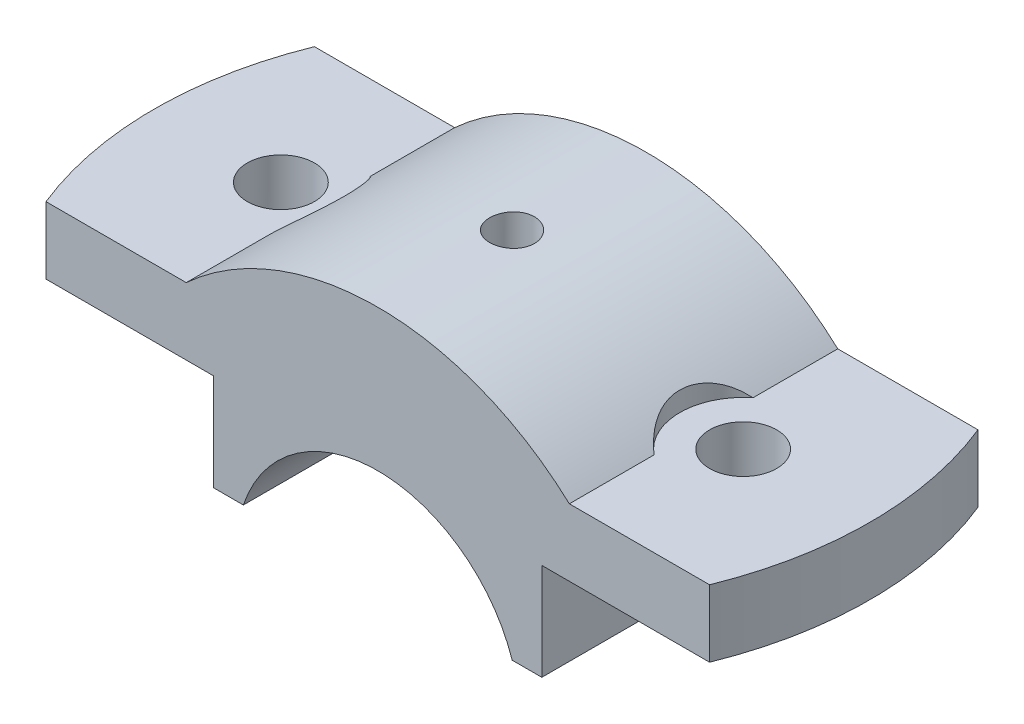
ISO-10303-21;
HEADER;
FILE_DESCRIPTION(('STEP AP214'),'2;1');
FILE_NAME('part.step','',(''),(''),'','','');
FILE_SCHEMA(('AUTOMOTIVE_DESIGN { 1 0 10303 214 1 1 1 1 }'));
ENDSEC;
DATA;
#1=APPLICATION_CONTEXT('core data for automotive mechanical design processes');
#2=APPLICATION_PROTOCOL_DEFINITION('international standard','automotive_design',2000,#1);
#3=PRODUCT_CONTEXT('',#1,'mechanical');
#4=PRODUCT('Part','Part','',(#3));
#5=PRODUCT_RELATED_PRODUCT_CATEGORY('part','',(#4));
#6=PRODUCT_DEFINITION_FORMATION('','',#4);
#7=PRODUCT_DEFINITION_CONTEXT('part definition',#1,'design');
#8=PRODUCT_DEFINITION('design','',#6,#7);
#9=PRODUCT_DEFINITION_SHAPE('','',#8);
#10=(LENGTH_UNIT() NAMED_UNIT(*) SI_UNIT(.MILLI.,.METRE.));
#11=(NAMED_UNIT(*) PLANE_ANGLE_UNIT() SI_UNIT($,.RADIAN.));
#12=(NAMED_UNIT(*) SI_UNIT($,.STERADIAN.) SOLID_ANGLE_UNIT());
#13=UNCERTAINTY_MEASURE_WITH_UNIT(LENGTH_MEASURE(1.E-05),#10,'distance_accuracy_value','');
#14=(GEOMETRIC_REPRESENTATION_CONTEXT(3) GLOBAL_UNCERTAINTY_ASSIGNED_CONTEXT((#13)) GLOBAL_UNIT_ASSIGNED_CONTEXT((#10,
#11,#12)) REPRESENTATION_CONTEXT('',''));
#15=CARTESIAN_POINT('',(0.,0.,0.));
#16=DIRECTION('',(0.,0.,1.));
#17=DIRECTION('',(1.,0.,0.));
#18=AXIS2_PLACEMENT_3D('',#15,#16,#17);
#19=CARTESIAN_POINT('',(0.,0.,18.));
#20=DIRECTION('',(0.,0.,-1.));
#21=DIRECTION('',(-1.,0.,0.));
#22=AXIS2_PLACEMENT_3D('',#19,#20,#21);
#23=CYLINDRICAL_SURFACE('',#22,38.);
#24=CARTESIAN_POINT('',(25.6904651573303,28.,-6.63768331230679));
#25=CARTESIAN_POINT('',(25.5360851043424,28.1416681018721,-6.51420867249736));
#26=CARTESIAN_POINT('',(25.3836215551735,28.2791823336498,-6.38340380017067));
#27=CARTESIAN_POINT('',(25.0841053598261,28.5451833866574,-6.1068595072457));
#28=CARTESIAN_POINT('',(24.9370580895264,28.6736613482156,-5.96110576476093));
#29=CARTESIAN_POINT('',(24.6491941230388,28.9215085426632,-5.653491442262));
#30=CARTESIAN_POINT('',(24.508431723833,29.0408031542341,-5.49151942353939));
#31=CARTESIAN_POINT('',(24.2363075607749,29.2682904084011,-5.15263687836669));
#32=CARTESIAN_POINT('',(24.1049430857226,29.3764862568107,-4.97573069263071));
#33=CARTESIAN_POINT('',(23.8528205053459,29.5815743674557,-4.60631493821572));
#34=CARTESIAN_POINT('',(23.7321338833277,29.6783916917415,-4.41371469093334));
#35=CARTESIAN_POINT('',(23.5043908446779,29.85908164754,-4.01479632179465));
#36=CARTESIAN_POINT('',(23.3973358972541,29.942952883943,-3.80847672492269));
#37=CARTESIAN_POINT('',(23.1992536300817,30.0966827286364,-3.38422419101504));
#38=CARTESIAN_POINT('',(23.1081729651955,30.1665880882949,-3.1663331999127));
#39=CARTESIAN_POINT('',(22.9434688496595,30.2920447623401,-2.72008092153075));
#40=CARTESIAN_POINT('',(22.869842066784,30.347598816803,-2.49172164276593));
#41=CARTESIAN_POINT('',(22.7499342032063,30.4375648556656,-2.05682098381956));
#42=CARTESIAN_POINT('',(22.7013462567531,30.4737833576563,-1.85128534823191));
#43=CARTESIAN_POINT('',(22.6194172898017,30.534645499234,-1.43551725204115));
#44=CARTESIAN_POINT('',(22.5860747992536,30.5592902548309,-1.22528524633891));
#45=CARTESIAN_POINT('',(22.5352129551669,30.5968164834569,-0.801799591498529));
#46=CARTESIAN_POINT('',(22.5176992505084,30.6096937569973,-0.588544891193923));
#47=CARTESIAN_POINT('',(22.4988301660851,30.6235658271181,-0.160939560666236));
#48=CARTESIAN_POINT('',(22.4974739036633,30.624561272785,0.0534110090511313));
#49=CARTESIAN_POINT('',(22.5103301119086,30.6151119876343,0.461997479818148));
#50=CARTESIAN_POINT('',(22.5231488228924,30.6056914251709,0.656303160135775));
#51=CARTESIAN_POINT('',(22.5619809221014,30.5770763766543,1.04286259298841));
#52=CARTESIAN_POINT('',(22.5879939672906,30.5578821447042,1.23511639873688));
#53=CARTESIAN_POINT('',(22.6528192304938,30.5098574663833,1.61613906729809));
#54=CARTESIAN_POINT('',(22.6916259266854,30.4810311771979,1.80490939654948));
#55=CARTESIAN_POINT('',(22.7814851533843,30.4139289484325,2.17779604427594));
#56=CARTESIAN_POINT('',(22.8325379785097,30.3756527815061,2.36191225066402));
#57=CARTESIAN_POINT('',(22.9463727274414,30.2897519777021,2.72495933677603));
#58=CARTESIAN_POINT('',(23.0091940590921,30.2420959034169,2.90387039063447));
#59=CARTESIAN_POINT('',(23.1456283742011,30.1378044455698,3.2548914886335));
#60=CARTESIAN_POINT('',(23.2192449894415,30.0811660396201,3.42699921914349));
#61=CARTESIAN_POINT('',(23.3763137314078,29.9592695660632,3.76349373210636));
#62=CARTESIAN_POINT('',(23.4597660818508,29.8940113023904,3.92788033882065));
#63=CARTESIAN_POINT('',(23.635527045378,29.7552415450916,4.24828704232642));
#64=CARTESIAN_POINT('',(23.7278387953854,29.6817271265587,4.40430414494655));
#65=CARTESIAN_POINT('',(23.9282386479047,29.5204551498757,4.71995510834892));
#66=CARTESIAN_POINT('',(24.0370002176616,29.432022004933,4.87881602386906));
#67=CARTESIAN_POINT('',(24.2623844714665,29.2465042091278,5.1856332961988));
#68=CARTESIAN_POINT('',(24.379010630913,29.149415727248,5.33358477081362));
#69=CARTESIAN_POINT('',(24.6187042069683,28.9472618083659,5.61815393006346));
#70=CARTESIAN_POINT('',(24.7417672458198,28.8422017715012,5.75477915839727));
#71=CARTESIAN_POINT('',(24.9931857635632,28.6246099475779,6.016738259449));
#72=CARTESIAN_POINT('',(25.121541230047,28.5120781780363,6.14207215863705));
#73=CARTESIAN_POINT('',(25.3239635142993,28.3320696328102,6.32788833390874));
#74=CARTESIAN_POINT('',(25.3966039536004,28.2669811541268,6.39227987552885));
#75=CARTESIAN_POINT('',(25.5428336292653,28.1349133065772,6.5175597465675));
#76=CARTESIAN_POINT('',(25.6164208573994,28.0679376662269,6.57845434819235));
#77=CARTESIAN_POINT('',(25.6904651573302,28.0000000000002,6.63768331230706));
#78=B_SPLINE_CURVE_WITH_KNOTS('',3,(#24,#25,#26,#27,#28,#29,#30,#31,#32,#33,#34,#35,#36,#37,#38,
#39,#40,#41,#42,#43,#44,#45,#46,#47,#48,#49,#50,#51,#52,#53,#54,#55,#56,#57,#58,#59,#60,#61,#62,
#63,#64,#65,#66,#67,#68,#69,#70,#71,#72,#73,#74,#75,#76,#77),.UNSPECIFIED.,.F.,.F.,(4,2,2,2,2,2,
2,2,2,2,2,2,2,2,2,2,2,2,2,2,2,2,2,2,2,2,4),(0.,0.729592400834074,1.45989044138352,
2.19560470883999,2.93110586753775,3.67120763552798,4.41138910352643,5.14904966030397,
5.8865692722368,6.52855006409985,7.17046893961489,7.8126168088522,8.45472959834446,
9.03890309081732,9.62306139629814,10.2069679046447,10.7908884620571,11.3768004587137,
11.9629100238154,12.549032922753,13.1353641263273,13.7703169673958,14.4055522594533,
15.040361004022,15.6751682603777,16.0257258218313,16.3756336015193),.UNSPECIFIED.);
#79=CARTESIAN_POINT('',(25.6904651573303,28.,-6.63768331230679));
#80=VERTEX_POINT('',#79);
#81=CARTESIAN_POINT('',(25.6904651573303,28.,6.6376833123068));
#82=VERTEX_POINT('',#81);
#83=EDGE_CURVE('E138',#80,#82,#78,.T.);
#84=ORIENTED_EDGE('',*,*,#83,.F.);
#85=DIRECTION('',(0.,0.,-1.));
#86=VECTOR('',#85,1.);
#87=CARTESIAN_POINT('',(25.6904651573303,28.,18.));
#88=LINE('',#87,#86);
#89=CARTESIAN_POINT('',(25.6904651573303,28.,-18.));
#90=VERTEX_POINT('',#89);
#91=EDGE_CURVE('E144',#80,#90,#88,.T.);
#92=ORIENTED_EDGE('',*,*,#91,.T.);
#93=CARTESIAN_POINT('',(0.,0.,-18.));
#94=DIRECTION('',(0.,0.,-1.));
#95=DIRECTION('',(-1.,0.,0.));
#96=AXIS2_PLACEMENT_3D('',#93,#94,#95);
#97=CIRCLE('',#96,38.);
#98=CARTESIAN_POINT('',(-25.6904651573303,28.,-18.));
#99=VERTEX_POINT('',#98);
#100=EDGE_CURVE('E255',#99,#90,#97,.T.);
#101=ORIENTED_EDGE('',*,*,#100,.F.);
#102=DIRECTION('',(0.,0.,-1.));
#103=VECTOR('',#102,1.);
#104=CARTESIAN_POINT('',(-25.6904651573303,28.,18.));
#105=LINE('',#104,#103);
#106=CARTESIAN_POINT('',(-25.6904651573303,28.,-6.63768331230679));
#107=VERTEX_POINT('',#106);
#108=EDGE_CURVE('E158',#107,#99,#105,.T.);
#109=ORIENTED_EDGE('',*,*,#108,.F.);
#110=CARTESIAN_POINT('',(-25.6904651573303,28.,-6.63768331230679));
#111=CARTESIAN_POINT('',(-25.5360851043424,28.1416681018721,-6.51420867249736));
#112=CARTESIAN_POINT('',(-25.3836215551735,28.2791823336498,-6.38340380017068));
#113=CARTESIAN_POINT('',(-25.0841053598261,28.5451833866574,-6.1068595072457));
#114=CARTESIAN_POINT('',(-24.9370580895264,28.6736613482156,-5.96110576476093));
#115=CARTESIAN_POINT('',(-24.6491941230388,28.9215085426632,-5.653491442262));
#116=CARTESIAN_POINT('',(-24.508431723833,29.0408031542341,-5.49151942353939));
#117=CARTESIAN_POINT('',(-24.2363075607749,29.2682904084011,-5.15263687836669));
#118=CARTESIAN_POINT('',(-24.1049430857226,29.3764862568107,-4.97573069263071));
#119=CARTESIAN_POINT('',(-23.8528205053459,29.5815743674557,-4.60631493821572));
#120=CARTESIAN_POINT('',(-23.7321338833277,29.6783916917415,-4.41371469093334));
#121=CARTESIAN_POINT('',(-23.5043908446779,29.85908164754,-4.01479632179465));
#122=CARTESIAN_POINT('',(-23.3973358972541,29.942952883943,-3.8084767249227));
#123=CARTESIAN_POINT('',(-23.1992536300817,30.0966827286364,-3.38422419101504));
#124=CARTESIAN_POINT('',(-23.1081729651955,30.1665880882949,-3.1663331999127));
#125=CARTESIAN_POINT('',(-22.9434688496595,30.2920447623401,-2.72008092153075));
#126=CARTESIAN_POINT('',(-22.869842066784,30.347598816803,-2.49172164276593));
#127=CARTESIAN_POINT('',(-22.7499342032063,30.4375648556656,-2.05682098381956));
#128=CARTESIAN_POINT('',(-22.7013462567531,30.4737833576563,-1.85128534823192));
#129=CARTESIAN_POINT('',(-22.6194172898017,30.534645499234,-1.43551725204115));
#130=CARTESIAN_POINT('',(-22.5860747992536,30.5592902548309,-1.22528524633891));
#131=CARTESIAN_POINT('',(-22.5352129551669,30.5968164834569,-0.801799591498531));
#132=CARTESIAN_POINT('',(-22.5176992505084,30.6096937569973,-0.588544891193925));
#133=CARTESIAN_POINT('',(-22.4988301660851,30.6235658271181,-0.160939560666238));
#134=CARTESIAN_POINT('',(-22.4974739036633,30.624561272785,0.0534110090511295));
#135=CARTESIAN_POINT('',(-22.5103301119086,30.6151119876343,0.461997479818146));
#136=CARTESIAN_POINT('',(-22.5231488228924,30.6056914251709,0.656303160135772));
#137=CARTESIAN_POINT('',(-22.5619809221014,30.5770763766543,1.04286259298841));
#138=CARTESIAN_POINT('',(-22.5879939672906,30.5578821447042,1.23511639873688));
#139=CARTESIAN_POINT('',(-22.6528192304938,30.5098574663833,1.61613906729809));
#140=CARTESIAN_POINT('',(-22.6916259266854,30.4810311771979,1.80490939654948));
#141=CARTESIAN_POINT('',(-22.7814851533843,30.4139289484325,2.17779604427593));
#142=CARTESIAN_POINT('',(-22.8325379785097,30.3756527815061,2.36191225066402));
#143=CARTESIAN_POINT('',(-22.9463727274414,30.2897519777021,2.72495933677603));
#144=CARTESIAN_POINT('',(-23.0091940590921,30.2420959034169,2.90387039063447));
#145=CARTESIAN_POINT('',(-23.1456283742011,30.1378044455698,3.2548914886335));
#146=CARTESIAN_POINT('',(-23.2192449894415,30.0811660396201,3.42699921914349));
#147=CARTESIAN_POINT('',(-23.3763137314078,29.9592695660632,3.76349373210636));
#148=CARTESIAN_POINT('',(-23.4597660818508,29.8940113023904,3.92788033882065));
#149=CARTESIAN_POINT('',(-23.635527045378,29.7552415450916,4.24828704232642));
#150=CARTESIAN_POINT('',(-23.7278387953854,29.6817271265587,4.40430414494655));
#151=CARTESIAN_POINT('',(-23.9282386479047,29.5204551498757,4.71995510834892));
#152=CARTESIAN_POINT('',(-24.0370002176616,29.432022004933,4.87881602386906));
#153=CARTESIAN_POINT('',(-24.2623844714665,29.2465042091278,5.1856332961988));
#154=CARTESIAN_POINT('',(-24.379010630913,29.1494157272481,5.33358477081362));
#155=CARTESIAN_POINT('',(-24.6187042069683,28.9472618083659,5.61815393006346));
#156=CARTESIAN_POINT('',(-24.7417672458198,28.8422017715012,5.75477915839727));
#157=CARTESIAN_POINT('',(-24.9931857635632,28.6246099475779,6.016738259449));
#158=CARTESIAN_POINT('',(-25.121541230047,28.5120781780363,6.14207215863705));
#159=CARTESIAN_POINT('',(-25.3239635142993,28.3320696328102,6.32788833390874));
#160=CARTESIAN_POINT('',(-25.3966039536004,28.2669811541268,6.39227987552885));
#161=CARTESIAN_POINT('',(-25.5428336292653,28.1349133065772,6.5175597465675));
#162=CARTESIAN_POINT('',(-25.6164208573994,28.0679376662269,6.57845434819235));
#163=CARTESIAN_POINT('',(-25.6904651573302,28.0000000000002,6.63768331230706));
#164=B_SPLINE_CURVE_WITH_KNOTS('',3,(#110,#111,#112,#113,#114,#115,#116,#117,#118,#119,#120,
#121,#122,#123,#124,#125,#126,#127,#128,#129,#130,#131,#132,#133,#134,#135,#136,#137,#138,#139,
#140,#141,#142,#143,#144,#145,#146,#147,#148,#149,#150,#151,#152,#153,#154,#155,#156,#157,#158,
#159,#160,#161,#162,#163),.UNSPECIFIED.,.F.,.F.,(4,2,2,2,2,2,2,2,2,2,2,2,2,2,2,2,2,2,2,2,2,2,2,
2,2,2,4),(0.,0.729592400834073,1.45989044138352,2.19560470883999,2.93110586753775,
3.67120763552798,4.41138910352643,5.14904966030397,5.88656927223679,6.52855006409984,
7.17046893961489,7.8126168088522,8.45472959834446,9.03890309081732,9.62306139629814,
10.2069679046447,10.7908884620571,11.3768004587137,11.9629100238154,12.549032922753,
13.1353641263273,13.7703169673958,14.4055522594533,15.040361004022,15.6751682603777,
16.0257258218313,16.3756336015193),.UNSPECIFIED.);
#165=CARTESIAN_POINT('',(-25.6904651573303,28.,6.63768331230679));
#166=VERTEX_POINT('',#165);
#167=EDGE_CURVE('E11',#107,#166,#164,.T.);
#168=ORIENTED_EDGE('',*,*,#167,.T.);
#169=CARTESIAN_POINT('',(-25.6904651573303,28.,18.));
#170=VERTEX_POINT('',#169);
#171=EDGE_CURVE('E155',#170,#166,#105,.T.);
#172=ORIENTED_EDGE('',*,*,#171,.F.);
#173=CARTESIAN_POINT('',(0.,0.,18.));
#174=DIRECTION('',(0.,0.,-1.));
#175=DIRECTION('',(-1.,0.,0.));
#176=AXIS2_PLACEMENT_3D('',#173,#174,#175);
#177=CIRCLE('',#176,38.);
#178=CARTESIAN_POINT('',(25.6904651573303,28.,18.));
#179=VERTEX_POINT('',#178);
#180=EDGE_CURVE('E325',#170,#179,#177,.T.);
#181=ORIENTED_EDGE('',*,*,#180,.T.);
#182=EDGE_CURVE('E147',#179,#82,#88,.T.);
#183=ORIENTED_EDGE('',*,*,#182,.T.);
#184=EDGE_LOOP('',(#84,#92,#101,#109,#168,#172,#181,#183));
#185=FACE_BOUND('',#184,.T.);
#186=CARTESIAN_POINT('',(0.,38.,2.99999999999999));
#187=CARTESIAN_POINT('',(0.168230277437706,37.9999984430739,2.99999263868346));
#188=CARTESIAN_POINT('',(0.336575845655095,37.9988709200709,2.98580169916932));
#189=CARTESIAN_POINT('',(0.668611397196741,37.9944814128081,2.92939894930333));
#190=CARTESIAN_POINT('',(0.832295850092008,37.9912169949171,2.88715518982943));
#191=CARTESIAN_POINT('',(1.15015205512757,37.9829226863334,2.77587406357067));
#192=CARTESIAN_POINT('',(1.3043290493551,37.9778937789402,2.70685161752221));
#193=CARTESIAN_POINT('',(1.59887136159142,37.9666348413683,2.54399853963546));
#194=CARTESIAN_POINT('',(1.73923967362019,37.9604050724332,2.45017330191646));
#195=CARTESIAN_POINT('',(2.00254103126273,37.9474277075509,2.24014409327318));
#196=CARTESIAN_POINT('',(2.12543792166292,37.9406790810774,2.1238948563935));
#197=CARTESIAN_POINT('',(2.34999780988339,37.9274332919605,1.87241281605956));
#198=CARTESIAN_POINT('',(2.45165988585507,37.9209361402441,1.73717918887838));
#199=CARTESIAN_POINT('',(2.63098484586302,37.9089176287414,1.45135065682847));
#200=CARTESIAN_POINT('',(2.708616254697,37.903397552738,1.30073594623714));
#201=CARTESIAN_POINT('',(2.83747510230931,37.8939696224707,0.988558849059875));
#202=CARTESIAN_POINT('',(2.88870296451239,37.8900617423529,0.826996638082311));
#203=CARTESIAN_POINT('',(2.96319644645853,37.8843090780475,0.497870679819643));
#204=CARTESIAN_POINT('',(2.98652059882487,37.8824599758018,0.330320257357771));
#205=CARTESIAN_POINT('',(3.00472536931325,37.8810204867557,-0.00632681714997883));
#206=CARTESIAN_POINT('',(2.99960647157769,37.8814300615093,-0.175423442828301));
#207=CARTESIAN_POINT('',(2.96111886260011,37.8844577346025,-0.50996231003528));
#208=CARTESIAN_POINT('',(2.92781369865023,37.8870708648728,-0.675411913710734));
#209=CARTESIAN_POINT('',(2.83399765916122,37.8942034046858,-0.998365215123261));
#210=CARTESIAN_POINT('',(2.77348654183749,37.8987228311701,-1.15586884222906));
#211=CARTESIAN_POINT('',(2.62690490032727,37.9091644380148,-1.45866214971911));
#212=CARTESIAN_POINT('',(2.54080579129679,37.9150881856644,-1.60393793599878));
#213=CARTESIAN_POINT('',(2.34551283184452,37.9276694800349,-1.87799978791044));
#214=CARTESIAN_POINT('',(2.23631856235736,37.9343270400699,-2.00678555426029));
#215=CARTESIAN_POINT('',(1.99757813910437,37.947647885739,-2.24458115896056));
#216=CARTESIAN_POINT('',(1.86797703439473,37.9543111370687,-2.35353583758633));
#217=CARTESIAN_POINT('',(1.59229376436976,37.9668751419437,-2.54815019879117));
#218=CARTESIAN_POINT('',(1.44621158946688,37.9727758950454,-2.63380986781872));
#219=CARTESIAN_POINT('',(1.14167761997914,37.983150993084,-2.77939892547026));
#220=CARTESIAN_POINT('',(0.983224692335489,37.9876252071703,-2.83932595392175));
#221=CARTESIAN_POINT('',(0.658463212690179,37.9946415451888,-2.93171041942903));
#222=CARTESIAN_POINT('',(0.492154807064348,37.997183705107,-2.96416836811962));
#223=CARTESIAN_POINT('',(0.156881478742687,38.0000448768352,-3.0006243444068));
#224=CARTESIAN_POINT('',(-0.0120751089608356,38.0003698415183,-3.00469857910482));
#225=CARTESIAN_POINT('',(-0.348269003373996,37.9987758913175,-2.98447098943402));
#226=CARTESIAN_POINT('',(-0.515506324442481,37.9968569951891,-2.96016940224688));
#227=CARTESIAN_POINT('',(-0.84329775373575,37.9909950041868,-2.88394314979588));
#228=CARTESIAN_POINT('',(-1.00386010671882,37.987054491835,-2.83205372367032));
#229=CARTESIAN_POINT('',(-1.31399900365978,37.9775920824189,-2.70216068710782));
#230=CARTESIAN_POINT('',(-1.46357539119334,37.9720701628431,-2.62415670492505));
#231=CARTESIAN_POINT('',(-1.7478437504178,37.9600494395666,-2.44405671040129));
#232=CARTESIAN_POINT('',(-1.88250358772922,37.953548595394,-2.34191011569745));
#233=CARTESIAN_POINT('',(-2.13279217984116,37.9403075453845,-2.1164976605111));
#234=CARTESIAN_POINT('',(-2.24842063776818,37.9335673358158,-1.99323147064188));
#235=CARTESIAN_POINT('',(-2.4576248497514,37.9205896766453,-1.72874864835165));
#236=CARTESIAN_POINT('',(-2.55115094155127,37.9143533795852,-1.58749266904679));
#237=CARTESIAN_POINT('',(-2.713155238272,37.9031055627809,-1.29123629441747));
#238=CARTESIAN_POINT('',(-2.78163367119924,37.8980940318878,-1.13623602422189));
#239=CARTESIAN_POINT('',(-2.89151387110068,37.8898693720601,-0.817068099787171));
#240=CARTESIAN_POINT('',(-2.93294623887224,37.8866542112497,-0.652911034998949));
#241=CARTESIAN_POINT('',(-2.98765790023766,37.8823793491511,-0.319943850373176));
#242=CARTESIAN_POINT('',(-3.00093767292138,37.8813196111828,-0.151133809767672));
#243=CARTESIAN_POINT('',(-2.99896188688675,37.8814760426207,0.18585385894292));
#244=CARTESIAN_POINT('',(-2.98378436644711,37.8826859878913,0.354031953001596));
#245=CARTESIAN_POINT('',(-2.92548733876923,37.887232237977,0.685442873019107));
#246=CARTESIAN_POINT('',(-2.8823677867555,37.8905685461995,0.848675691052985));
#247=CARTESIAN_POINT('',(-2.7694300101543,37.8989899804525,1.1655689968701));
#248=CARTESIAN_POINT('',(-2.69961296444521,37.9040750292632,1.31922990697071));
#249=CARTESIAN_POINT('',(-2.535271096382,37.9154210711218,1.61266178094886));
#250=CARTESIAN_POINT('',(-2.44074672054794,37.9216820429175,1.75243299578316));
#251=CARTESIAN_POINT('',(-2.22938062382269,37.9346948182221,2.01451680288399));
#252=CARTESIAN_POINT('',(-2.11248130954251,37.941447859921,2.13678288515432));
#253=CARTESIAN_POINT('',(-1.85978424897896,37.954672635902,2.36000556130416));
#254=CARTESIAN_POINT('',(-1.72398192526551,37.9611443015481,2.46095697881558));
#255=CARTESIAN_POINT('',(-1.43709756450133,37.9730876131211,2.6388054256755));
#256=CARTESIAN_POINT('',(-1.28598975831931,37.978557527474,2.71566096437293));
#257=CARTESIAN_POINT('',(-0.973076064569831,37.9878601967286,2.8428120018995));
#258=CARTESIAN_POINT('',(-0.811282773093932,37.9916948408735,2.89313816633251));
#259=CARTESIAN_POINT('',(-0.540438770546247,37.9963056825779,2.95292296572033));
#260=CARTESIAN_POINT('',(-0.433132098217291,37.9976847801056,2.97055353917027));
#261=CARTESIAN_POINT('',(-0.217232975456251,37.9995324404705,2.99409441950641));
#262=CARTESIAN_POINT('',(-0.108640528034263,38.0000010054389,3.0000047538251));
#263=CARTESIAN_POINT('',(0.,38.,2.99999999999999));
#264=B_SPLINE_CURVE_WITH_KNOTS('',3,(#186,#187,#188,#189,#190,#191,#192,#193,#194,#195,#196,
#197,#198,#199,#200,#201,#202,#203,#204,#205,#206,#207,#208,#209,#210,#211,#212,#213,#214,#215,
#216,#217,#218,#219,#220,#221,#222,#223,#224,#225,#226,#227,#228,#229,#230,#231,#232,#233,#234,
#235,#236,#237,#238,#239,#240,#241,#242,#243,#244,#245,#246,#247,#248,#249,#250,#251,#252,#253,
#254,#255,#256,#257,#258,#259,#260,#261,#262,#263),.UNSPECIFIED.,.T.,.F.,(4,2,2,2,2,2,2,2,2,2,2,
2,2,2,2,2,2,2,2,2,2,2,2,2,2,2,2,2,2,2,2,2,2,2,2,2,2,2,4),(0.,0.50429418854674,1.00916370078726,
1.51375230936014,2.01823126998903,2.52373945491489,3.02926958047039,3.53545907123702,
4.04164044416132,4.54675814609821,5.05186725021795,5.55584058602808,6.05981840083593,
6.56436134901272,7.06891345298728,7.57484819748388,8.08078323629979,8.58676466907349,
9.09273667730811,9.5973496818578,10.1019584685879,10.6059242398502,11.1098971854695,
11.6149355386039,12.1199817691652,12.6261522324058,13.1323180879118,13.6379102536977,
14.1434938154447,14.6476929456065,15.1518928837201,15.6560705605014,16.1602391262259,
16.6657233184336,17.1713301290485,17.6778028214877,18.183688785524,18.5093549854356,
18.8350204230892),.UNSPECIFIED.);
#265=CARTESIAN_POINT('',(0.,38.,2.99999999999999));
#266=VERTEX_POINT('',#265);
#267=EDGE_CURVE('E165',#266,#266,#264,.T.);
#268=ORIENTED_EDGE('',*,*,#267,.F.);
#269=EDGE_LOOP('',(#268));
#270=FACE_BOUND('',#269,.T.);
#271=ADVANCED_FACE('F32',(#185,#270),#23,.T.);
#272=CARTESIAN_POINT('',(-50.,28.,18.));
#273=DIRECTION('',(0.,1.,0.));
#274=DIRECTION('',(-1.,0.,0.));
#275=AXIS2_PLACEMENT_3D('',#272,#273,#274);
#276=PLANE('',#275);
#277=CARTESIAN_POINT('',(-31.,28.,0.));
#278=DIRECTION('',(0.,1.,0.));
#279=DIRECTION('',(0.,0.,1.));
#280=AXIS2_PLACEMENT_3D('',#277,#278,#279);
#281=CIRCLE('',#280,4.49999999999999);
#282=CARTESIAN_POINT('',(-31.,28.,4.49999999999999));
#283=VERTEX_POINT('',#282);
#284=EDGE_CURVE('E246',#283,#283,#281,.T.);
#285=ORIENTED_EDGE('',*,*,#284,.F.);
#286=EDGE_LOOP('',(#285));
#287=FACE_BOUND('',#286,.T.);
#288=DIRECTION('',(1.,0.,0.));
#289=VECTOR('',#288,1.);
#290=CARTESIAN_POINT('',(-50.,28.,-18.));
#291=LINE('',#290,#289);
#292=CARTESIAN_POINT('',(-44.497190922574,28.,-18.));
#293=VERTEX_POINT('',#292);
#294=EDGE_CURVE('E250',#293,#99,#291,.T.);
#295=ORIENTED_EDGE('',*,*,#294,.F.);
#296=CARTESIAN_POINT('',(0.,28.,0.));
#297=DIRECTION('',(0.,1.,0.));
#298=DIRECTION('',(1.,0.,0.));
#299=AXIS2_PLACEMENT_3D('',#296,#297,#298);
#300=CIRCLE('',#299,48.);
#301=CARTESIAN_POINT('',(-44.497190922574,28.,18.));
#302=VERTEX_POINT('',#301);
#303=EDGE_CURVE('E251',#293,#302,#300,.T.);
#304=ORIENTED_EDGE('',*,*,#303,.T.);
#305=DIRECTION('',(1.,0.,0.));
#306=VECTOR('',#305,1.);
#307=CARTESIAN_POINT('',(-50.,28.,18.));
#308=LINE('',#307,#306);
#309=EDGE_CURVE('E285',#302,#170,#308,.T.);
#310=ORIENTED_EDGE('',*,*,#309,.T.);
#311=ORIENTED_EDGE('',*,*,#171,.T.);
#312=CARTESIAN_POINT('',(-31.,28.,0.));
#313=DIRECTION('',(0.,1.,0.));
#314=DIRECTION('',(-1.,0.,0.));
#315=AXIS2_PLACEMENT_3D('',#312,#313,#314);
#316=CIRCLE('',#315,8.5);
#317=EDGE_CURVE('E59',#166,#107,#316,.T.);
#318=ORIENTED_EDGE('',*,*,#317,.T.);
#319=ORIENTED_EDGE('',*,*,#108,.T.);
#320=EDGE_LOOP('',(#295,#304,#310,#311,#318,#319));
#321=FACE_BOUND('',#320,.T.);
#322=ADVANCED_FACE('F34',(#287,#321),#276,.T.);
#323=CARTESIAN_POINT('',(-22.,19.,18.));
#324=DIRECTION('',(0.,-1.,0.));
#325=DIRECTION('',(0.,0.,-1.));
#326=AXIS2_PLACEMENT_3D('',#323,#324,#325);
#327=PLANE('',#326);
#328=CARTESIAN_POINT('',(-31.,19.,0.));
#329=DIRECTION('',(0.,-1.,0.));
#330=DIRECTION('',(0.,0.,-1.));
#331=AXIS2_PLACEMENT_3D('',#328,#329,#330);
#332=CIRCLE('',#331,4.49999999999999);
#333=CARTESIAN_POINT('',(-31.,19.,-4.49999999999999));
#334=VERTEX_POINT('',#333);
#335=EDGE_CURVE('E357',#334,#334,#332,.T.);
#336=ORIENTED_EDGE('',*,*,#335,.F.);
#337=EDGE_LOOP('',(#336));
#338=FACE_BOUND('',#337,.T.);
#339=DIRECTION('',(-1.,0.,0.));
#340=VECTOR('',#339,1.);
#341=CARTESIAN_POINT('',(-22.,19.,18.));
#342=LINE('',#341,#340);
#343=CARTESIAN_POINT('',(-22.,19.,18.));
#344=VERTEX_POINT('',#343);
#345=CARTESIAN_POINT('',(-44.497190922574,19.,18.));
#346=VERTEX_POINT('',#345);
#347=EDGE_CURVE('E263',#344,#346,#342,.T.);
#348=ORIENTED_EDGE('',*,*,#347,.T.);
#349=CARTESIAN_POINT('',(0.,19.,0.));
#350=DIRECTION('',(0.,-1.,0.));
#351=DIRECTION('',(0.,0.,-1.));
#352=AXIS2_PLACEMENT_3D('',#349,#350,#351);
#353=CIRCLE('',#352,48.);
#354=CARTESIAN_POINT('',(-44.497190922574,19.,-18.));
#355=VERTEX_POINT('',#354);
#356=EDGE_CURVE('E345',#346,#355,#353,.T.);
#357=ORIENTED_EDGE('',*,*,#356,.T.);
#358=DIRECTION('',(-1.,0.,0.));
#359=VECTOR('',#358,1.);
#360=CARTESIAN_POINT('',(-22.,19.,-18.));
#361=LINE('',#360,#359);
#362=CARTESIAN_POINT('',(-22.,19.,-18.));
#363=VERTEX_POINT('',#362);
#364=EDGE_CURVE('E282',#363,#355,#361,.T.);
#365=ORIENTED_EDGE('',*,*,#364,.F.);
#366=DIRECTION('',(0.,0.,-1.));
#367=VECTOR('',#366,1.);
#368=CARTESIAN_POINT('',(-22.,19.,18.));
#369=LINE('',#368,#367);
#370=EDGE_CURVE('E166',#344,#363,#369,.T.);
#371=ORIENTED_EDGE('',*,*,#370,.F.);
#372=EDGE_LOOP('',(#348,#357,#365,#371));
#373=FACE_BOUND('',#372,.T.);
#374=ADVANCED_FACE('F198',(#338,#373),#327,.T.);
#375=CARTESIAN_POINT('',(0.,0.,18.));
#376=DIRECTION('',(0.,0.,-1.));
#377=DIRECTION('',(-1.,0.,0.));
#378=AXIS2_PLACEMENT_3D('',#375,#376,#377);
#379=PLANE('',#378);
#380=DIRECTION('',(0.,1.,0.));
#381=VECTOR('',#380,1.);
#382=CARTESIAN_POINT('',(-44.497190922574,-8.,18.));
#383=LINE('',#382,#381);
#384=EDGE_CURVE('E348',#346,#302,#383,.T.);
#385=ORIENTED_EDGE('',*,*,#384,.F.);
#386=ORIENTED_EDGE('',*,*,#347,.F.);
#387=DIRECTION('',(0.,1.,0.));
#388=VECTOR('',#387,1.);
#389=CARTESIAN_POINT('',(-22.,6.,18.));
#390=LINE('',#389,#388);
#391=CARTESIAN_POINT('',(-22.,6.,18.));
#392=VERTEX_POINT('',#391);
#393=EDGE_CURVE('E337',#392,#344,#390,.T.);
#394=ORIENTED_EDGE('',*,*,#393,.F.);
#395=DIRECTION('',(-1.,0.,0.));
#396=VECTOR('',#395,1.);
#397=CARTESIAN_POINT('',(-18.0277563773199,6.,18.));
#398=LINE('',#397,#396);
#399=CARTESIAN_POINT('',(-18.0277563773199,6.,18.));
#400=VERTEX_POINT('',#399);
#401=EDGE_CURVE('E335',#400,#392,#398,.T.);
#402=ORIENTED_EDGE('',*,*,#401,.F.);
#403=CARTESIAN_POINT('',(0.,0.,18.));
#404=DIRECTION('',(0.,0.,-1.));
#405=DIRECTION('',(-1.,0.,0.));
#406=AXIS2_PLACEMENT_3D('',#403,#404,#405);
#407=CIRCLE('',#406,19.);
#408=CARTESIAN_POINT('',(18.0277563773199,6.,18.));
#409=VERTEX_POINT('',#408);
#410=EDGE_CURVE('E333',#400,#409,#407,.T.);
#411=ORIENTED_EDGE('',*,*,#410,.T.);
#412=DIRECTION('',(1.,0.,0.));
#413=VECTOR('',#412,1.);
#414=CARTESIAN_POINT('',(18.0277563773199,6.,18.));
#415=LINE('',#414,#413);
#416=CARTESIAN_POINT('',(22.,6.,18.));
#417=VERTEX_POINT('',#416);
#418=EDGE_CURVE('E331',#409,#417,#415,.T.);
#419=ORIENTED_EDGE('',*,*,#418,.T.);
#420=DIRECTION('',(0.,1.,0.));
#421=VECTOR('',#420,1.);
#422=CARTESIAN_POINT('',(22.,6.,18.));
#423=LINE('',#422,#421);
#424=CARTESIAN_POINT('',(22.,19.,18.));
#425=VERTEX_POINT('',#424);
#426=EDGE_CURVE('E329',#417,#425,#423,.T.);
#427=ORIENTED_EDGE('',*,*,#426,.T.);
#428=DIRECTION('',(1.,0.,0.));
#429=VECTOR('',#428,1.);
#430=CARTESIAN_POINT('',(22.,19.,18.));
#431=LINE('',#430,#429);
#432=CARTESIAN_POINT('',(44.497190922574,19.,18.));
#433=VERTEX_POINT('',#432);
#434=EDGE_CURVE('E305',#425,#433,#431,.T.);
#435=ORIENTED_EDGE('',*,*,#434,.T.);
#436=DIRECTION('',(0.,1.,0.));
#437=VECTOR('',#436,1.);
#438=CARTESIAN_POINT('',(44.497190922574,-8.,18.));
#439=LINE('',#438,#437);
#440=CARTESIAN_POINT('',(44.497190922574,28.,18.));
#441=VERTEX_POINT('',#440);
#442=EDGE_CURVE('E312',#433,#441,#439,.T.);
#443=ORIENTED_EDGE('',*,*,#442,.T.);
#444=DIRECTION('',(-1.,0.,0.));
#445=VECTOR('',#444,1.);
#446=CARTESIAN_POINT('',(50.,28.,18.));
#447=LINE('',#446,#445);
#448=EDGE_CURVE('E311',#441,#179,#447,.T.);
#449=ORIENTED_EDGE('',*,*,#448,.T.);
#450=ORIENTED_EDGE('',*,*,#180,.F.);
#451=ORIENTED_EDGE('',*,*,#309,.F.);
#452=EDGE_LOOP('',(#385,#386,#394,#402,#411,#419,#427,#435,#443,#449,#450,#451));
#453=FACE_BOUND('',#452,.T.);
#454=ADVANCED_FACE('F194',(#453),#379,.F.);
#455=CARTESIAN_POINT('',(0.,0.,-18.));
#456=DIRECTION('',(0.,0.,-1.));
#457=DIRECTION('',(-1.,0.,0.));
#458=AXIS2_PLACEMENT_3D('',#455,#456,#457);
#459=PLANE('',#458);
#460=ORIENTED_EDGE('',*,*,#364,.T.);
#461=DIRECTION('',(0.,1.,0.));
#462=VECTOR('',#461,1.);
#463=CARTESIAN_POINT('',(-44.497190922574,-8.,-18.));
#464=LINE('',#463,#462);
#465=EDGE_CURVE('E44',#355,#293,#464,.T.);
#466=ORIENTED_EDGE('',*,*,#465,.T.);
#467=ORIENTED_EDGE('',*,*,#294,.T.);
#468=ORIENTED_EDGE('',*,*,#100,.T.);
#469=DIRECTION('',(-1.,0.,0.));
#470=VECTOR('',#469,1.);
#471=CARTESIAN_POINT('',(50.,28.,-18.));
#472=LINE('',#471,#470);
#473=CARTESIAN_POINT('',(44.497190922574,28.,-18.));
#474=VERTEX_POINT('',#473);
#475=EDGE_CURVE('E153',#474,#90,#472,.T.);
#476=ORIENTED_EDGE('',*,*,#475,.F.);
#477=DIRECTION('',(0.,1.,0.));
#478=VECTOR('',#477,1.);
#479=CARTESIAN_POINT('',(44.497190922574,-8.,-18.));
#480=LINE('',#479,#478);
#481=CARTESIAN_POINT('',(44.497190922574,19.,-18.));
#482=VERTEX_POINT('',#481);
#483=EDGE_CURVE('E163',#482,#474,#480,.T.);
#484=ORIENTED_EDGE('',*,*,#483,.F.);
#485=DIRECTION('',(1.,0.,0.));
#486=VECTOR('',#485,1.);
#487=CARTESIAN_POINT('',(22.,19.,-18.));
#488=LINE('',#487,#486);
#489=CARTESIAN_POINT('',(22.,19.,-18.));
#490=VERTEX_POINT('',#489);
#491=EDGE_CURVE('E267',#490,#482,#488,.T.);
#492=ORIENTED_EDGE('',*,*,#491,.F.);
#493=DIRECTION('',(0.,1.,0.));
#494=VECTOR('',#493,1.);
#495=CARTESIAN_POINT('',(22.,6.,-18.));
#496=LINE('',#495,#494);
#497=CARTESIAN_POINT('',(22.,6.,-18.));
#498=VERTEX_POINT('',#497);
#499=EDGE_CURVE('E270',#498,#490,#496,.T.);
#500=ORIENTED_EDGE('',*,*,#499,.F.);
#501=DIRECTION('',(1.,0.,0.));
#502=VECTOR('',#501,1.);
#503=CARTESIAN_POINT('',(18.0277563773199,6.,-18.));
#504=LINE('',#503,#502);
#505=CARTESIAN_POINT('',(18.0277563773199,6.,-18.));
#506=VERTEX_POINT('',#505);
#507=EDGE_CURVE('E272',#506,#498,#504,.T.);
#508=ORIENTED_EDGE('',*,*,#507,.F.);
#509=CARTESIAN_POINT('',(0.,0.,-18.));
#510=DIRECTION('',(0.,0.,-1.));
#511=DIRECTION('',(-1.,0.,0.));
#512=AXIS2_PLACEMENT_3D('',#509,#510,#511);
#513=CIRCLE('',#512,19.);
#514=CARTESIAN_POINT('',(-18.0277563773199,6.,-18.));
#515=VERTEX_POINT('',#514);
#516=EDGE_CURVE('E274',#515,#506,#513,.T.);
#517=ORIENTED_EDGE('',*,*,#516,.F.);
#518=DIRECTION('',(-1.,0.,0.));
#519=VECTOR('',#518,1.);
#520=CARTESIAN_POINT('',(-18.0277563773199,6.,-18.));
#521=LINE('',#520,#519);
#522=CARTESIAN_POINT('',(-22.,6.,-18.));
#523=VERTEX_POINT('',#522);
#524=EDGE_CURVE('E276',#515,#523,#521,.T.);
#525=ORIENTED_EDGE('',*,*,#524,.T.);
#526=DIRECTION('',(0.,1.,0.));
#527=VECTOR('',#526,1.);
#528=CARTESIAN_POINT('',(-22.,6.,-18.));
#529=LINE('',#528,#527);
#530=EDGE_CURVE('E279',#523,#363,#529,.T.);
#531=ORIENTED_EDGE('',*,*,#530,.T.);
#532=EDGE_LOOP('',(#460,#466,#467,#468,#476,#484,#492,#500,#508,#517,#525,#531));
#533=FACE_BOUND('',#532,.T.);
#534=ADVANCED_FACE('F197',(#533),#459,.T.);
#535=CARTESIAN_POINT('',(-22.,6.,18.));
#536=DIRECTION('',(-1.,0.,0.));
#537=DIRECTION('',(0.,0.,1.));
#538=AXIS2_PLACEMENT_3D('',#535,#536,#537);
#539=PLANE('',#538);
#540=ORIENTED_EDGE('',*,*,#530,.F.);
#541=DIRECTION('',(0.,0.,-1.));
#542=VECTOR('',#541,1.);
#543=CARTESIAN_POINT('',(-22.,6.,18.));
#544=LINE('',#543,#542);
#545=EDGE_CURVE('E287',#392,#523,#544,.T.);
#546=ORIENTED_EDGE('',*,*,#545,.F.);
#547=ORIENTED_EDGE('',*,*,#393,.T.);
#548=ORIENTED_EDGE('',*,*,#370,.T.);
#549=EDGE_LOOP('',(#540,#546,#547,#548));
#550=FACE_BOUND('',#549,.T.);
#551=ADVANCED_FACE('F202',(#550),#539,.T.);
#552=CARTESIAN_POINT('',(-18.0277563773199,6.,18.));
#553=DIRECTION('',(0.,-1.,0.));
#554=DIRECTION('',(0.,0.,-1.));
#555=AXIS2_PLACEMENT_3D('',#552,#553,#554);
#556=PLANE('',#555);
#557=ORIENTED_EDGE('',*,*,#524,.F.);
#558=DIRECTION('',(0.,0.,-1.));
#559=VECTOR('',#558,1.);
#560=CARTESIAN_POINT('',(-18.0277563773199,6.,18.));
#561=LINE('',#560,#559);
#562=EDGE_CURVE('E289',#400,#515,#561,.T.);
#563=ORIENTED_EDGE('',*,*,#562,.F.);
#564=ORIENTED_EDGE('',*,*,#401,.T.);
#565=ORIENTED_EDGE('',*,*,#545,.T.);
#566=EDGE_LOOP('',(#557,#563,#564,#565));
#567=FACE_BOUND('',#566,.T.);
#568=ADVANCED_FACE('F209',(#567),#556,.T.);
#569=CARTESIAN_POINT('',(0.,0.,18.));
#570=DIRECTION('',(0.,0.,-1.));
#571=DIRECTION('',(-1.,0.,0.));
#572=AXIS2_PLACEMENT_3D('',#569,#570,#571);
#573=CYLINDRICAL_SURFACE('',#572,19.);
#574=CARTESIAN_POINT('',(0.,19.,-2.49999999999999));
#575=CARTESIAN_POINT('',(-0.139778315489381,18.999997967774,-2.49999410094606));
#576=CARTESIAN_POINT('',(-0.279642447495432,18.9984412683557,-2.4882376747585));
#577=CARTESIAN_POINT('',(-0.555474474016762,18.9923810422329,-2.44152700403634));
#578=CARTESIAN_POINT('',(-0.691438217949601,18.9878744896332,-2.40654893872551));
#579=CARTESIAN_POINT('',(-0.95543664292526,18.9764219373405,-2.31444705906101));
#580=CARTESIAN_POINT('',(-1.08347675216936,18.9694776299244,-2.25733860465933));
#581=CARTESIAN_POINT('',(-1.32813277832855,18.9539206812215,-2.12263165454414));
#582=CARTESIAN_POINT('',(-1.44475055826476,18.9453083126858,-2.04503650793575));
#583=CARTESIAN_POINT('',(-1.66398308687908,18.9273173646443,-1.87105538112386));
#584=CARTESIAN_POINT('',(-1.76651843289981,18.9179348817316,-1.77456973952704));
#585=CARTESIAN_POINT('',(-1.95399133146886,18.8994924119599,-1.56576064733008));
#586=CARTESIAN_POINT('',(-2.0389279601093,18.890432442053,-1.4534363657436));
#587=CARTESIAN_POINT('',(-2.18909162338546,18.8736225658863,-1.21561789849417));
#588=CARTESIAN_POINT('',(-2.254243636291,18.8658776941045,-1.09007595594652));
#589=CARTESIAN_POINT('',(-2.36250946256606,18.8526269269547,-0.829713309668848));
#590=CARTESIAN_POINT('',(-2.40562420041089,18.8471209376663,-0.694892995440664));
#591=CARTESIAN_POINT('',(-2.46834893112871,18.8390089488849,-0.420627771177583));
#592=CARTESIAN_POINT('',(-2.48809350572304,18.8363863510935,-0.281214139706501));
#593=CARTESIAN_POINT('',(-2.50393399543623,18.8342874081065,-0.00102942145374077));
#594=CARTESIAN_POINT('',(-2.50003096100306,18.8348109231579,0.139741604753912));
#595=CARTESIAN_POINT('',(-2.46879737750757,18.8389298660036,0.417704097944481));
#596=CARTESIAN_POINT('',(-2.44161547626707,18.8425058020086,0.554912597936802));
#597=CARTESIAN_POINT('',(-2.36482786882149,18.852296258763,0.822803762753462));
#598=CARTESIAN_POINT('',(-2.31522166359116,18.8585108382319,0.953486282278278));
#599=CARTESIAN_POINT('',(-2.19483509097754,18.8729003199956,1.20507533515602));
#600=CARTESIAN_POINT('',(-2.12399053069556,18.8810811502029,1.3259507990106));
#601=CARTESIAN_POINT('',(-1.96318413435717,18.8984768576706,1.55415393130078));
#602=CARTESIAN_POINT('',(-1.87322133002782,18.9076917872934,1.66148091311361));
#603=CARTESIAN_POINT('',(-1.67591027855668,18.9262039286229,1.8604029509214));
#604=CARTESIAN_POINT('',(-1.5684339827901,18.9355012293485,1.95187103488116));
#605=CARTESIAN_POINT('',(-1.33958658891131,18.9530645440151,2.11548884034054));
#606=CARTESIAN_POINT('',(-1.21821545257771,18.9613305551191,2.18763850869798));
#607=CARTESIAN_POINT('',(-0.964922757293812,18.9759058695861,2.31057308687671));
#608=CARTESIAN_POINT('',(-0.832997072631035,18.9822144030351,2.36134959301125));
#609=CARTESIAN_POINT('',(-0.562390331231885,18.9921571388021,2.43999334343767));
#610=CARTESIAN_POINT('',(-0.423709625549347,18.9957914799383,2.46786177690379));
#611=CARTESIAN_POINT('',(-0.144626841595051,18.9999582136113,2.49973268466771));
#612=CARTESIAN_POINT('',(-0.00424505397900215,19.0005133278906,2.50390998199235));
#613=CARTESIAN_POINT('',(0.275216665266614,18.9985205333266,2.48874205734629));
#614=CARTESIAN_POINT('',(0.414296627611642,18.9959726978817,2.46939739177318));
#615=CARTESIAN_POINT('',(0.686687509149987,18.9880744020358,2.40787994096774));
#616=CARTESIAN_POINT('',(0.82001767900448,18.9827342327916,2.36579096106222));
#617=CARTESIAN_POINT('',(1.07772769061604,18.9698488481686,2.26006706877666));
#618=CARTESIAN_POINT('',(1.20210719868891,18.9623035506347,2.19643135362991));
#619=CARTESIAN_POINT('',(1.4391630355531,18.9457917882835,2.04900056518347));
#620=CARTESIAN_POINT('',(1.55176881159961,18.9368174879556,1.96509294211363));
#621=CARTESIAN_POINT('',(1.76136182953434,18.9184749473973,1.77965876593363));
#622=CARTESIAN_POINT('',(1.85834838132061,18.9091066897838,1.67813143474596));
#623=CARTESIAN_POINT('',(2.03457405133124,18.8909615049602,1.45956767417581));
#624=CARTESIAN_POINT('',(2.11369695379328,18.882188695812,1.34243714901302));
#625=CARTESIAN_POINT('',(2.25114524350547,18.8662967388838,1.0964463235499));
#626=CARTESIAN_POINT('',(2.30947108507653,18.8591775549807,0.967586279563249));
#627=CARTESIAN_POINT('',(2.40348340588748,18.8474274353122,0.702162244798238));
#628=CARTESIAN_POINT('',(2.43923433050312,18.8427894223098,0.565621407141433));
#629=CARTESIAN_POINT('',(2.48728896692711,18.8365068588229,0.288409154438021));
#630=CARTESIAN_POINT('',(2.49959389747028,18.834862152745,0.147737954475759));
#631=CARTESIAN_POINT('',(2.50038325713135,18.8347572836292,-0.132585217903333));
#632=CARTESIAN_POINT('',(2.48905029281034,18.8362727080524,-0.272236701943021));
#633=CARTESIAN_POINT('',(2.44327339157393,18.8422647251658,-0.547631014500266));
#634=CARTESIAN_POINT('',(2.40882946081796,18.8467413170668,-0.683373844059528));
#635=CARTESIAN_POINT('',(2.31786734754335,18.8581434764999,-0.947066981095642));
#636=CARTESIAN_POINT('',(2.2613589504226,18.8650679582854,-1.0750207139318));
#637=CARTESIAN_POINT('',(2.12788991460023,18.8805873470396,-1.31965972423879));
#638=CARTESIAN_POINT('',(2.05092891076782,18.8891822838294,-1.4363448004849));
#639=CARTESIAN_POINT('',(1.87806508524071,18.9071536004537,-1.6560664344298));
#640=CARTESIAN_POINT('',(1.78202633147282,18.916535291463,-1.75899562327552));
#641=CARTESIAN_POINT('',(1.57401834863998,18.9349767535594,-1.94734544374448));
#642=CARTESIAN_POINT('',(1.46204538383396,18.9440364485309,-2.03276195806477));
#643=CARTESIAN_POINT('',(1.22480279057949,18.9608556769231,-2.1839722390681));
#644=CARTESIAN_POINT('',(1.09947920166897,18.9686095798624,-2.24968193582437));
#645=CARTESIAN_POINT('',(0.839540973043678,18.9818871351467,-2.35902730105118));
#646=CARTESIAN_POINT('',(0.704936491101716,18.9874131818538,-2.40268668066816));
#647=CARTESIAN_POINT('',(0.474714442967833,18.9942975150946,-2.45637452622466));
#648=CARTESIAN_POINT('',(0.380541684686486,18.9964253917168,-2.47271020697245));
#649=CARTESIAN_POINT('',(0.19092595858504,18.9992773223142,-2.49452491255805));
#650=CARTESIAN_POINT('',(0.0954830015668613,19.0000013882199,-2.50000402966205));
#651=CARTESIAN_POINT('',(0.,19.,-2.49999999999999));
#652=B_SPLINE_CURVE_WITH_KNOTS('',3,(#574,#575,#576,#577,#578,#579,#580,#581,#582,#583,#584,
#585,#586,#587,#588,#589,#590,#591,#592,#593,#594,#595,#596,#597,#598,#599,#600,#601,#602,#603,
#604,#605,#606,#607,#608,#609,#610,#611,#612,#613,#614,#615,#616,#617,#618,#619,#620,#621,#622,
#623,#624,#625,#626,#627,#628,#629,#630,#631,#632,#633,#634,#635,#636,#637,#638,#639,#640,#641,
#642,#643,#644,#645,#646,#647,#648,#649,#650,#651),.UNSPECIFIED.,.T.,.F.,(4,2,2,2,2,2,2,2,2,2,2,
2,2,2,2,2,2,2,2,2,2,2,2,2,2,2,2,2,2,2,2,2,2,2,2,2,2,2,4),(0.,0.418986144750714,0.83840275129503,
1.25752877489171,1.67658632335898,2.09791737096996,2.5192705322666,2.94220203521431,
3.36511579450621,3.78558208482051,4.20602969778294,4.62381238038422,5.04160436068183,
5.46067207111284,5.87976101093414,6.30206422391832,6.72436859858555,7.1468388638243,
7.56928719694781,7.98861407741506,8.40793103915516,8.82571338706285,9.24351130200041,
9.66368440831746,10.0838760739927,10.5067272952287,10.9295692785285,11.3511986374782,
11.7728060793191,12.1911686022117,12.6095310136043,13.027708095279,13.4458926429742,
13.8671712161902,14.2885487204711,14.7116990687392,15.1343934209873,15.4206065905888,
15.7068173277526),.UNSPECIFIED.);
#653=CARTESIAN_POINT('',(0.,19.,-2.49999999999999));
#654=VERTEX_POINT('',#653);
#655=EDGE_CURVE('E317',#654,#654,#652,.T.);
#656=ORIENTED_EDGE('',*,*,#655,.T.);
#657=EDGE_LOOP('',(#656));
#658=FACE_BOUND('',#657,.T.);
#659=ORIENTED_EDGE('',*,*,#516,.T.);
#660=DIRECTION('',(0.,0.,-1.));
#661=VECTOR('',#660,1.);
#662=CARTESIAN_POINT('',(18.0277563773199,6.,18.));
#663=LINE('',#662,#661);
#664=EDGE_CURVE('E291',#409,#506,#663,.T.);
#665=ORIENTED_EDGE('',*,*,#664,.F.);
#666=ORIENTED_EDGE('',*,*,#410,.F.);
#667=ORIENTED_EDGE('',*,*,#562,.T.);
#668=EDGE_LOOP('',(#659,#665,#666,#667));
#669=FACE_BOUND('',#668,.T.);
#670=ADVANCED_FACE('F213',(#658,#669),#573,.F.);
#671=CARTESIAN_POINT('',(18.0277563773199,6.,18.));
#672=DIRECTION('',(0.,1.,0.));
#673=DIRECTION('',(0.,0.,1.));
#674=AXIS2_PLACEMENT_3D('',#671,#672,#673);
#675=PLANE('',#674);
#676=ORIENTED_EDGE('',*,*,#507,.T.);
#677=DIRECTION('',(0.,0.,-1.));
#678=VECTOR('',#677,1.);
#679=CARTESIAN_POINT('',(22.,6.,18.));
#680=LINE('',#679,#678);
#681=EDGE_CURVE('E293',#417,#498,#680,.T.);
#682=ORIENTED_EDGE('',*,*,#681,.F.);
#683=ORIENTED_EDGE('',*,*,#418,.F.);
#684=ORIENTED_EDGE('',*,*,#664,.T.);
#685=EDGE_LOOP('',(#676,#682,#683,#684));
#686=FACE_BOUND('',#685,.T.);
#687=ADVANCED_FACE('F217',(#686),#675,.F.);
#688=CARTESIAN_POINT('',(22.,6.,18.));
#689=DIRECTION('',(-1.,0.,0.));
#690=DIRECTION('',(0.,0.,1.));
#691=AXIS2_PLACEMENT_3D('',#688,#689,#690);
#692=PLANE('',#691);
#693=ORIENTED_EDGE('',*,*,#499,.T.);
#694=DIRECTION('',(0.,0.,-1.));
#695=VECTOR('',#694,1.);
#696=CARTESIAN_POINT('',(22.,19.,18.));
#697=LINE('',#696,#695);
#698=EDGE_CURVE('E157',#425,#490,#697,.T.);
#699=ORIENTED_EDGE('',*,*,#698,.F.);
#700=ORIENTED_EDGE('',*,*,#426,.F.);
#701=ORIENTED_EDGE('',*,*,#681,.T.);
#702=EDGE_LOOP('',(#693,#699,#700,#701));
#703=FACE_BOUND('',#702,.T.);
#704=ADVANCED_FACE('F221',(#703),#692,.F.);
#705=CARTESIAN_POINT('',(22.,19.,18.));
#706=DIRECTION('',(0.,1.,0.));
#707=DIRECTION('',(0.,0.,1.));
#708=AXIS2_PLACEMENT_3D('',#705,#706,#707);
#709=PLANE('',#708);
#710=CARTESIAN_POINT('',(31.,19.,0.));
#711=DIRECTION('',(0.,1.,0.));
#712=DIRECTION('',(0.,0.,1.));
#713=AXIS2_PLACEMENT_3D('',#710,#711,#712);
#714=CIRCLE('',#713,4.49999999999999);
#715=CARTESIAN_POINT('',(31.,19.,4.49999999999999));
#716=VERTEX_POINT('',#715);
#717=EDGE_CURVE('E256',#716,#716,#714,.T.);
#718=ORIENTED_EDGE('',*,*,#717,.T.);
#719=EDGE_LOOP('',(#718));
#720=FACE_BOUND('',#719,.T.);
#721=ORIENTED_EDGE('',*,*,#491,.T.);
#722=CARTESIAN_POINT('',(0.,19.,0.));
#723=DIRECTION('',(0.,1.,0.));
#724=DIRECTION('',(0.,0.,1.));
#725=AXIS2_PLACEMENT_3D('',#722,#723,#724);
#726=CIRCLE('',#725,48.);
#727=EDGE_CURVE('E310',#482,#433,#726,.F.);
#728=ORIENTED_EDGE('',*,*,#727,.T.);
#729=ORIENTED_EDGE('',*,*,#434,.F.);
#730=ORIENTED_EDGE('',*,*,#698,.T.);
#731=EDGE_LOOP('',(#721,#728,#729,#730));
#732=FACE_BOUND('',#731,.T.);
#733=ADVANCED_FACE('F225',(#720,#732),#709,.F.);
#734=CARTESIAN_POINT('',(50.,28.,18.));
#735=DIRECTION('',(0.,-1.,0.));
#736=DIRECTION('',(1.,0.,0.));
#737=AXIS2_PLACEMENT_3D('',#734,#735,#736);
#738=PLANE('',#737);
#739=CARTESIAN_POINT('',(31.,28.,0.));
#740=DIRECTION('',(0.,1.,0.));
#741=DIRECTION('',(0.,0.,1.));
#742=AXIS2_PLACEMENT_3D('',#739,#740,#741);
#743=CIRCLE('',#742,4.49999999999999);
#744=CARTESIAN_POINT('',(31.,28.,4.49999999999999));
#745=VERTEX_POINT('',#744);
#746=EDGE_CURVE('E260',#745,#745,#743,.T.);
#747=ORIENTED_EDGE('',*,*,#746,.F.);
#748=EDGE_LOOP('',(#747));
#749=FACE_BOUND('',#748,.T.);
#750=ORIENTED_EDGE('',*,*,#448,.F.);
#751=CARTESIAN_POINT('',(0.,28.,0.));
#752=DIRECTION('',(0.,-1.,0.));
#753=DIRECTION('',(-1.,0.,0.));
#754=AXIS2_PLACEMENT_3D('',#751,#752,#753);
#755=CIRCLE('',#754,48.);
#756=EDGE_CURVE('E308',#474,#441,#755,.T.);
#757=ORIENTED_EDGE('',*,*,#756,.F.);
#758=ORIENTED_EDGE('',*,*,#475,.T.);
#759=ORIENTED_EDGE('',*,*,#91,.F.);
#760=CARTESIAN_POINT('',(31.,28.,0.));
#761=DIRECTION('',(0.,-1.,0.));
#762=DIRECTION('',(1.,0.,0.));
#763=AXIS2_PLACEMENT_3D('',#760,#761,#762);
#764=CIRCLE('',#763,8.5);
#765=EDGE_CURVE('E51',#82,#80,#764,.T.);
#766=ORIENTED_EDGE('',*,*,#765,.F.);
#767=ORIENTED_EDGE('',*,*,#182,.F.);
#768=EDGE_LOOP('',(#750,#757,#758,#759,#766,#767));
#769=FACE_BOUND('',#768,.T.);
#770=ADVANCED_FACE('F150',(#749,#769),#738,.F.);
#771=CARTESIAN_POINT('',(31.,28.,0.));
#772=DIRECTION('',(0.,1.,0.));
#773=DIRECTION('',(0.,0.,1.));
#774=AXIS2_PLACEMENT_3D('',#771,#772,#773);
#775=CYLINDRICAL_SURFACE('',#774,4.49999999999999);
#776=ORIENTED_EDGE('',*,*,#746,.T.);
#777=EDGE_LOOP('',(#776));
#778=FACE_BOUND('',#777,.T.);
#779=ORIENTED_EDGE('',*,*,#717,.F.);
#780=EDGE_LOOP('',(#779));
#781=FACE_BOUND('',#780,.T.);
#782=ADVANCED_FACE('F189',(#778,#781),#775,.F.);
#783=CARTESIAN_POINT('',(0.,-8.00000000000001,0.));
#784=DIRECTION('',(0.,1.,0.));
#785=DIRECTION('',(-1.,0.,0.));
#786=AXIS2_PLACEMENT_3D('',#783,#784,#785);
#787=CYLINDRICAL_SURFACE('',#786,48.);
#788=ORIENTED_EDGE('',*,*,#483,.T.);
#789=ORIENTED_EDGE('',*,*,#756,.T.);
#790=ORIENTED_EDGE('',*,*,#442,.F.);
#791=ORIENTED_EDGE('',*,*,#727,.F.);
#792=EDGE_LOOP('',(#788,#789,#790,#791));
#793=FACE_BOUND('',#792,.T.);
#794=ADVANCED_FACE('F185',(#793),#787,.T.);
#795=CARTESIAN_POINT('',(0.,25.,0.));
#796=DIRECTION('',(0.,1.,0.));
#797=DIRECTION('',(0.,0.,1.));
#798=AXIS2_PLACEMENT_3D('',#795,#796,#797);
#799=CONICAL_SURFACE('',#798,3.,1.02974425867665);
#800=CARTESIAN_POINT('',(0.,24.6995696904862,0.));
#801=DIRECTION('',(0.,1.,0.));
#802=DIRECTION('',(0.,0.,1.));
#803=AXIS2_PLACEMENT_3D('',#800,#801,#802);
#804=CIRCLE('',#803,2.49999999999999);
#805=CARTESIAN_POINT('',(0.,24.6995696904862,2.49999999999999));
#806=VERTEX_POINT('',#805);
#807=EDGE_CURVE('E360',#806,#806,#804,.F.);
#808=ORIENTED_EDGE('',*,*,#807,.T.);
#809=EDGE_LOOP('',(#808));
#810=FACE_BOUND('',#809,.T.);
#811=CARTESIAN_POINT('',(0.,25.,0.));
#812=DIRECTION('',(0.,1.,0.));
#813=DIRECTION('',(0.,0.,1.));
#814=AXIS2_PLACEMENT_3D('',#811,#812,#813);
#815=CIRCLE('',#814,3.);
#816=CARTESIAN_POINT('',(0.,25.,3.));
#817=VERTEX_POINT('',#816);
#818=EDGE_CURVE('E313',#817,#817,#815,.T.);
#819=ORIENTED_EDGE('',*,*,#818,.T.);
#820=EDGE_LOOP('',(#819));
#821=FACE_BOUND('',#820,.T.);
#822=ADVANCED_FACE('F179',(#810,#821),#799,.F.);
#823=CARTESIAN_POINT('',(0.,38.,0.));
#824=DIRECTION('',(0.,1.,0.));
#825=DIRECTION('',(0.,0.,1.));
#826=AXIS2_PLACEMENT_3D('',#823,#824,#825);
#827=CYLINDRICAL_SURFACE('',#826,2.99999999999999);
#828=ORIENTED_EDGE('',*,*,#267,.T.);
#829=EDGE_LOOP('',(#828));
#830=FACE_BOUND('',#829,.T.);
#831=ORIENTED_EDGE('',*,*,#818,.F.);
#832=EDGE_LOOP('',(#831));
#833=FACE_BOUND('',#832,.T.);
#834=ADVANCED_FACE('F173',(#830,#833),#827,.F.);
#835=CARTESIAN_POINT('',(0.,19.,0.));
#836=DIRECTION('',(0.,-1.,0.));
#837=DIRECTION('',(0.,0.,-1.));
#838=AXIS2_PLACEMENT_3D('',#835,#836,#837);
#839=CYLINDRICAL_SURFACE('',#838,2.49999999999999);
#840=ORIENTED_EDGE('',*,*,#655,.F.);
#841=EDGE_LOOP('',(#840));
#842=FACE_BOUND('',#841,.T.);
#843=ORIENTED_EDGE('',*,*,#807,.F.);
#844=EDGE_LOOP('',(#843));
#845=FACE_BOUND('',#844,.T.);
#846=ADVANCED_FACE('F178',(#842,#845),#839,.F.);
#847=CARTESIAN_POINT('',(-31.,28.,0.));
#848=DIRECTION('',(0.,1.,0.));
#849=DIRECTION('',(0.,0.,1.));
#850=AXIS2_PLACEMENT_3D('',#847,#848,#849);
#851=CYLINDRICAL_SURFACE('',#850,4.49999999999999);
#852=ORIENTED_EDGE('',*,*,#335,.T.);
#853=EDGE_LOOP('',(#852));
#854=FACE_BOUND('',#853,.T.);
#855=ORIENTED_EDGE('',*,*,#284,.T.);
#856=EDGE_LOOP('',(#855));
#857=FACE_BOUND('',#856,.T.);
#858=ADVANCED_FACE('F368',(#854,#857),#851,.F.);
#859=CARTESIAN_POINT('',(0.,-8.00000000000001,0.));
#860=DIRECTION('',(0.,1.,0.));
#861=DIRECTION('',(-1.,0.,0.));
#862=AXIS2_PLACEMENT_3D('',#859,#860,#861);
#863=CYLINDRICAL_SURFACE('',#862,48.);
#864=ORIENTED_EDGE('',*,*,#384,.T.);
#865=ORIENTED_EDGE('',*,*,#303,.F.);
#866=ORIENTED_EDGE('',*,*,#465,.F.);
#867=ORIENTED_EDGE('',*,*,#356,.F.);
#868=EDGE_LOOP('',(#864,#865,#866,#867));
#869=FACE_BOUND('',#868,.T.);
#870=ADVANCED_FACE('F371',(#869),#863,.T.);
#871=CARTESIAN_POINT('',(-31.,38.,0.));
#872=DIRECTION('',(0.,-1.,0.));
#873=DIRECTION('',(1.,0.,0.));
#874=AXIS2_PLACEMENT_3D('',#871,#872,#873);
#875=CYLINDRICAL_SURFACE('',#874,8.5);
#876=ORIENTED_EDGE('',*,*,#317,.F.);
#877=ORIENTED_EDGE('',*,*,#167,.F.);
#878=EDGE_LOOP('',(#876,#877));
#879=FACE_BOUND('',#878,.T.);
#880=ADVANCED_FACE('F374',(#879),#875,.F.);
#881=CARTESIAN_POINT('',(31.,38.,0.));
#882=DIRECTION('',(0.,-1.,0.));
#883=DIRECTION('',(1.,0.,0.));
#884=AXIS2_PLACEMENT_3D('',#881,#882,#883);
#885=CYLINDRICAL_SURFACE('',#884,8.5);
#886=ORIENTED_EDGE('',*,*,#83,.T.);
#887=ORIENTED_EDGE('',*,*,#765,.T.);
#888=EDGE_LOOP('',(#886,#887));
#889=FACE_BOUND('',#888,.T.);
#890=ADVANCED_FACE('F137',(#889),#885,.F.);
#891=CLOSED_SHELL('',(#271,#322,#374,#454,#534,#551,#568,#670,#687,#704,#733,#770,#782,#794,
#822,#834,#846,#858,#870,#880,#890));
#892=MANIFOLD_SOLID_BREP('B2',#891);
#893=ADVANCED_BREP_SHAPE_REPRESENTATION('',(#18,#892),#14);
#894=SHAPE_DEFINITION_REPRESENTATION(#9,#893);
ENDSEC;
END-ISO-10303-21;
